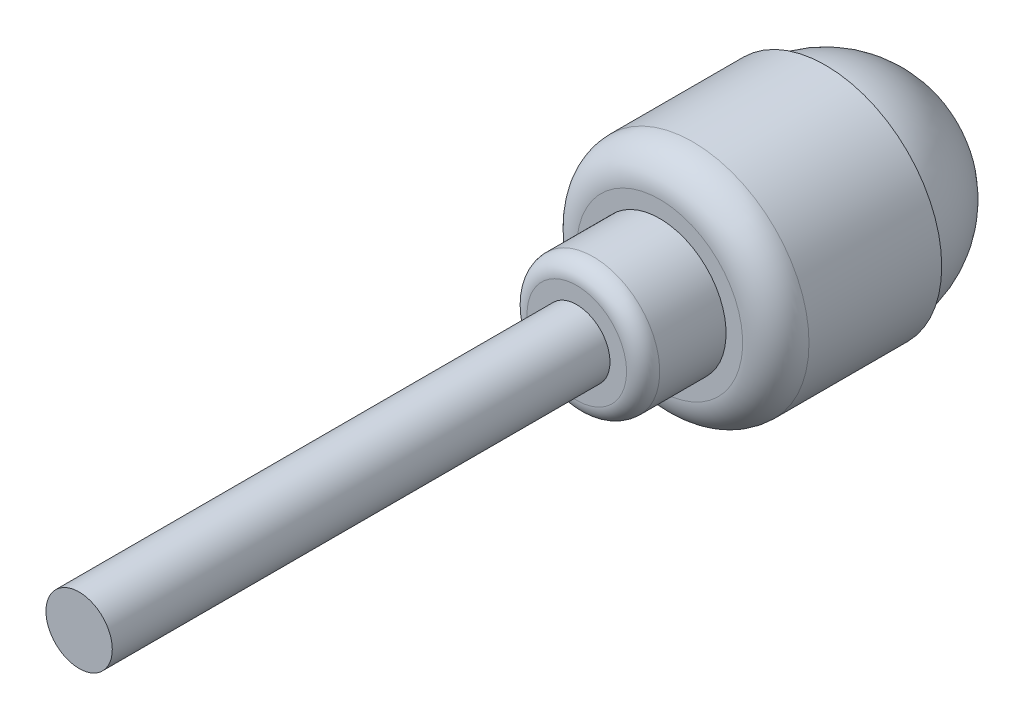
ISO-10303-21;
HEADER;
FILE_DESCRIPTION(('STEP AP214'),'2;1');
FILE_NAME('part.step','',(''),(''),'','','');
FILE_SCHEMA(('AUTOMOTIVE_DESIGN { 1 0 10303 214 1 1 1 1 }'));
ENDSEC;
DATA;
#1=APPLICATION_CONTEXT('core data for automotive mechanical design processes');
#2=APPLICATION_PROTOCOL_DEFINITION('international standard','automotive_design',2000,#1);
#3=PRODUCT_CONTEXT('',#1,'mechanical');
#4=PRODUCT('Part','Part','',(#3));
#5=PRODUCT_RELATED_PRODUCT_CATEGORY('part','',(#4));
#6=PRODUCT_DEFINITION_FORMATION('','',#4);
#7=PRODUCT_DEFINITION_CONTEXT('part definition',#1,'design');
#8=PRODUCT_DEFINITION('design','',#6,#7);
#9=PRODUCT_DEFINITION_SHAPE('','',#8);
#10=(LENGTH_UNIT() NAMED_UNIT(*) SI_UNIT(.MILLI.,.METRE.));
#11=(NAMED_UNIT(*) PLANE_ANGLE_UNIT() SI_UNIT($,.RADIAN.));
#12=(NAMED_UNIT(*) SI_UNIT($,.STERADIAN.) SOLID_ANGLE_UNIT());
#13=UNCERTAINTY_MEASURE_WITH_UNIT(LENGTH_MEASURE(1.E-05),#10,'distance_accuracy_value','');
#14=(GEOMETRIC_REPRESENTATION_CONTEXT(3) GLOBAL_UNCERTAINTY_ASSIGNED_CONTEXT((#13)) GLOBAL_UNIT_ASSIGNED_CONTEXT((#10,
#11,#12)) REPRESENTATION_CONTEXT('',''));
#15=CARTESIAN_POINT('',(0.,0.,0.));
#16=DIRECTION('',(0.,0.,1.));
#17=DIRECTION('',(1.,0.,0.));
#18=AXIS2_PLACEMENT_3D('',#15,#16,#17);
#19=CARTESIAN_POINT('',(0.,0.,0.));
#20=DIRECTION('',(0.,0.,-1.));
#21=DIRECTION('',(-1.,0.,0.));
#22=AXIS2_PLACEMENT_3D('',#19,#20,#21);
#23=PLANE('',#22);
#24=CARTESIAN_POINT('',(0.,0.,0.));
#25=DIRECTION('',(0.,0.,-1.));
#26=DIRECTION('',(-1.,0.,0.));
#27=AXIS2_PLACEMENT_3D('',#24,#25,#26);
#28=CIRCLE('',#27,3.);
#29=CARTESIAN_POINT('',(-3.,0.,0.));
#30=VERTEX_POINT('',#29);
#31=EDGE_CURVE('E10',#30,#30,#28,.F.);
#32=ORIENTED_EDGE('',*,*,#31,.T.);
#33=EDGE_LOOP('',(#32));
#34=FACE_BOUND('',#33,.T.);
#35=CARTESIAN_POINT('',(0.,0.,0.));
#36=DIRECTION('',(0.,0.,1.));
#37=DIRECTION('',(1.,0.,0.));
#38=AXIS2_PLACEMENT_3D('',#35,#36,#37);
#39=CIRCLE('',#38,2.);
#40=CARTESIAN_POINT('',(2.,0.,0.));
#41=VERTEX_POINT('',#40);
#42=EDGE_CURVE('E57',#41,#41,#39,.T.);
#43=ORIENTED_EDGE('',*,*,#42,.F.);
#44=EDGE_LOOP('',(#43));
#45=FACE_BOUND('',#44,.T.);
#46=ADVANCED_FACE('F37',(#34,#45),#23,.F.);
#47=CARTESIAN_POINT('',(0.,0.,-21.5));
#48=DIRECTION('',(0.,0.,-1.));
#49=DIRECTION('',(-1.,0.,0.));
#50=AXIS2_PLACEMENT_3D('',#47,#48,#49);
#51=CYLINDRICAL_SURFACE('',#50,4.);
#52=CARTESIAN_POINT('',(0.,0.,-1.));
#53=DIRECTION('',(0.,0.,-1.));
#54=DIRECTION('',(-1.,0.,0.));
#55=AXIS2_PLACEMENT_3D('',#52,#53,#54);
#56=CIRCLE('',#55,4.);
#57=CARTESIAN_POINT('',(-4.,0.,-1.));
#58=VERTEX_POINT('',#57);
#59=EDGE_CURVE('E44',#58,#58,#56,.T.);
#60=ORIENTED_EDGE('',*,*,#59,.T.);
#61=EDGE_LOOP('',(#60));
#62=FACE_BOUND('',#61,.T.);
#63=CARTESIAN_POINT('',(0.,0.,-5.));
#64=DIRECTION('',(0.,0.,-1.));
#65=DIRECTION('',(-1.,0.,0.));
#66=AXIS2_PLACEMENT_3D('',#63,#64,#65);
#67=CIRCLE('',#66,4.);
#68=CARTESIAN_POINT('',(-4.,0.,-5.));
#69=VERTEX_POINT('',#68);
#70=EDGE_CURVE('E58',#69,#69,#67,.T.);
#71=ORIENTED_EDGE('',*,*,#70,.F.);
#72=EDGE_LOOP('',(#71));
#73=FACE_BOUND('',#72,.T.);
#74=ADVANCED_FACE('F83',(#62,#73),#51,.T.);
#75=CARTESIAN_POINT('',(4.,0.,-5.));
#76=DIRECTION('',(0.,0.,-1.));
#77=DIRECTION('',(-1.,0.,0.));
#78=AXIS2_PLACEMENT_3D('',#75,#76,#77);
#79=PLANE('',#78);
#80=CARTESIAN_POINT('',(0.,0.,-5.));
#81=DIRECTION('',(0.,0.,-1.));
#82=DIRECTION('',(-1.,0.,0.));
#83=AXIS2_PLACEMENT_3D('',#80,#81,#82);
#84=CIRCLE('',#83,5.);
#85=CARTESIAN_POINT('',(-5.,0.,-5.));
#86=VERTEX_POINT('',#85);
#87=EDGE_CURVE('E48',#86,#86,#84,.F.);
#88=ORIENTED_EDGE('',*,*,#87,.T.);
#89=EDGE_LOOP('',(#88));
#90=FACE_BOUND('',#89,.T.);
#91=ORIENTED_EDGE('',*,*,#70,.T.);
#92=EDGE_LOOP('',(#91));
#93=FACE_BOUND('',#92,.T.);
#94=ADVANCED_FACE('F88',(#90,#93),#79,.F.);
#95=CARTESIAN_POINT('',(0.,0.,-21.5));
#96=DIRECTION('',(0.,0.,-1.));
#97=DIRECTION('',(-1.,0.,0.));
#98=AXIS2_PLACEMENT_3D('',#95,#96,#97);
#99=CYLINDRICAL_SURFACE('',#98,7.);
#100=CARTESIAN_POINT('',(0.,0.,-7.));
#101=DIRECTION('',(0.,0.,-1.));
#102=DIRECTION('',(-1.,0.,0.));
#103=AXIS2_PLACEMENT_3D('',#100,#101,#102);
#104=CIRCLE('',#103,7.);
#105=CARTESIAN_POINT('',(-7.,0.,-7.));
#106=VERTEX_POINT('',#105);
#107=EDGE_CURVE('E52',#106,#106,#104,.T.);
#108=ORIENTED_EDGE('',*,*,#107,.T.);
#109=EDGE_LOOP('',(#108));
#110=FACE_BOUND('',#109,.T.);
#111=CARTESIAN_POINT('',(0.,0.,-15.));
#112=DIRECTION('',(0.,0.,-1.));
#113=DIRECTION('',(-1.,0.,0.));
#114=AXIS2_PLACEMENT_3D('',#111,#112,#113);
#115=CIRCLE('',#114,7.);
#116=CARTESIAN_POINT('',(-7.,0.,-15.));
#117=VERTEX_POINT('',#116);
#118=EDGE_CURVE('E61',#117,#117,#115,.T.);
#119=ORIENTED_EDGE('',*,*,#118,.F.);
#120=EDGE_LOOP('',(#119));
#121=FACE_BOUND('',#120,.T.);
#122=ADVANCED_FACE('F104',(#110,#121),#99,.T.);
#123=CARTESIAN_POINT('',(7.,0.,-15.));
#124=DIRECTION('',(0.,0.,1.));
#125=DIRECTION('',(1.,0.,0.));
#126=AXIS2_PLACEMENT_3D('',#123,#124,#125);
#127=PLANE('',#126);
#128=CARTESIAN_POINT('',(0.,0.,-15.));
#129=DIRECTION('',(0.,0.,-1.));
#130=DIRECTION('',(-1.,0.,0.));
#131=AXIS2_PLACEMENT_3D('',#128,#129,#130);
#132=CIRCLE('',#131,6.5);
#133=CARTESIAN_POINT('',(-6.5,0.,-15.));
#134=VERTEX_POINT('',#133);
#135=EDGE_CURVE('E64',#134,#134,#132,.T.);
#136=ORIENTED_EDGE('',*,*,#135,.F.);
#137=EDGE_LOOP('',(#136));
#138=FACE_BOUND('',#137,.T.);
#139=ORIENTED_EDGE('',*,*,#118,.T.);
#140=EDGE_LOOP('',(#139));
#141=FACE_BOUND('',#140,.T.);
#142=ADVANCED_FACE('F107',(#138,#141),#127,.F.);
#143=CARTESIAN_POINT('',(0.,0.,-15.));
#144=DIRECTION('',(0.,0.,-1.));
#145=DIRECTION('',(1.,0.,0.));
#146=AXIS2_PLACEMENT_3D('',#143,#144,#145);
#147=SPHERICAL_SURFACE('',#146,6.5);
#148=ORIENTED_EDGE('',*,*,#135,.T.);
#149=EDGE_LOOP('',(#148));
#150=FACE_BOUND('',#149,.T.);
#151=ADVANCED_FACE('F78',(#150),#147,.T.);
#152=CARTESIAN_POINT('',(0.,0.,30.));
#153=DIRECTION('',(0.,0.,-1.));
#154=DIRECTION('',(-1.,0.,0.));
#155=AXIS2_PLACEMENT_3D('',#152,#153,#154);
#156=CYLINDRICAL_SURFACE('',#155,2.);
#157=CARTESIAN_POINT('',(0.,0.,30.));
#158=DIRECTION('',(0.,0.,1.));
#159=DIRECTION('',(1.,0.,0.));
#160=AXIS2_PLACEMENT_3D('',#157,#158,#159);
#161=CIRCLE('',#160,2.);
#162=CARTESIAN_POINT('',(2.,0.,30.));
#163=VERTEX_POINT('',#162);
#164=EDGE_CURVE('E67',#163,#163,#161,.T.);
#165=ORIENTED_EDGE('',*,*,#164,.F.);
#166=EDGE_LOOP('',(#165));
#167=FACE_BOUND('',#166,.T.);
#168=ORIENTED_EDGE('',*,*,#42,.T.);
#169=EDGE_LOOP('',(#168));
#170=FACE_BOUND('',#169,.T.);
#171=ADVANCED_FACE('F75',(#167,#170),#156,.T.);
#172=CARTESIAN_POINT('',(0.,0.,30.));
#173=DIRECTION('',(0.,0.,1.));
#174=DIRECTION('',(1.,0.,0.));
#175=AXIS2_PLACEMENT_3D('',#172,#173,#174);
#176=PLANE('',#175);
#177=ORIENTED_EDGE('',*,*,#164,.T.);
#178=EDGE_LOOP('',(#177));
#179=FACE_BOUND('',#178,.T.);
#180=ADVANCED_FACE('F73',(#179),#176,.T.);
#181=CARTESIAN_POINT('',(0.,0.,-7.));
#182=DIRECTION('',(0.,0.,-1.));
#183=DIRECTION('',(-1.,0.,0.));
#184=AXIS2_PLACEMENT_3D('',#181,#182,#183);
#185=TOROIDAL_SURFACE('',#184,5.,2.);
#186=ORIENTED_EDGE('',*,*,#87,.F.);
#187=EDGE_LOOP('',(#186));
#188=FACE_BOUND('',#187,.T.);
#189=ORIENTED_EDGE('',*,*,#107,.F.);
#190=EDGE_LOOP('',(#189));
#191=FACE_BOUND('',#190,.T.);
#192=ADVANCED_FACE('F91',(#188,#191),#185,.T.);
#193=CARTESIAN_POINT('',(0.,0.,-1.));
#194=DIRECTION('',(0.,0.,-1.));
#195=DIRECTION('',(-1.,0.,0.));
#196=AXIS2_PLACEMENT_3D('',#193,#194,#195);
#197=TOROIDAL_SURFACE('',#196,3.,1.);
#198=ORIENTED_EDGE('',*,*,#31,.F.);
#199=EDGE_LOOP('',(#198));
#200=FACE_BOUND('',#199,.T.);
#201=ORIENTED_EDGE('',*,*,#59,.F.);
#202=EDGE_LOOP('',(#201));
#203=FACE_BOUND('',#202,.T.);
#204=ADVANCED_FACE('F39',(#200,#203),#197,.T.);
#205=CLOSED_SHELL('',(#46,#74,#94,#122,#142,#151,#171,#180,#192,#204));
#206=MANIFOLD_SOLID_BREP('B2',#205);
#207=ADVANCED_BREP_SHAPE_REPRESENTATION('',(#18,#206),#14);
#208=SHAPE_DEFINITION_REPRESENTATION(#9,#207);
ENDSEC;
END-ISO-10303-21;
